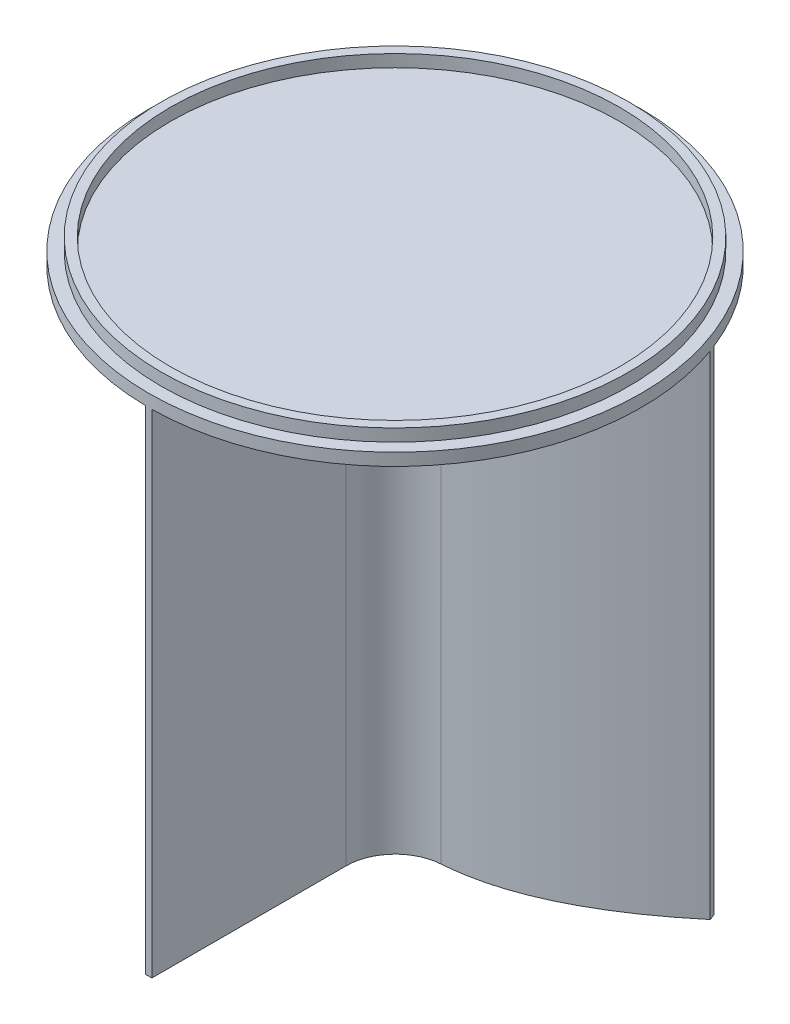
ISO-10303-21;
HEADER;
FILE_DESCRIPTION(('STEP AP214'),'2;1');
FILE_NAME('part.step','',(''),(''),'','','');
FILE_SCHEMA(('AUTOMOTIVE_DESIGN { 1 0 10303 214 1 1 1 1 }'));
ENDSEC;
DATA;
#1=APPLICATION_CONTEXT('core data for automotive mechanical design processes');
#2=APPLICATION_PROTOCOL_DEFINITION('international standard','automotive_design',2000,#1);
#3=PRODUCT_CONTEXT('',#1,'mechanical');
#4=PRODUCT('Part','Part','',(#3));
#5=PRODUCT_RELATED_PRODUCT_CATEGORY('part','',(#4));
#6=PRODUCT_DEFINITION_FORMATION('','',#4);
#7=PRODUCT_DEFINITION_CONTEXT('part definition',#1,'design');
#8=PRODUCT_DEFINITION('design','',#6,#7);
#9=PRODUCT_DEFINITION_SHAPE('','',#8);
#10=(LENGTH_UNIT() NAMED_UNIT(*) SI_UNIT(.MILLI.,.METRE.));
#11=(NAMED_UNIT(*) PLANE_ANGLE_UNIT() SI_UNIT($,.RADIAN.));
#12=(NAMED_UNIT(*) SI_UNIT($,.STERADIAN.) SOLID_ANGLE_UNIT());
#13=UNCERTAINTY_MEASURE_WITH_UNIT(LENGTH_MEASURE(1.E-05),#10,'distance_accuracy_value','');
#14=(GEOMETRIC_REPRESENTATION_CONTEXT(3) GLOBAL_UNCERTAINTY_ASSIGNED_CONTEXT((#13)) GLOBAL_UNIT_ASSIGNED_CONTEXT((#10,
#11,#12)) REPRESENTATION_CONTEXT('',''));
#15=CARTESIAN_POINT('',(0.,0.,0.));
#16=DIRECTION('',(0.,0.,1.));
#17=DIRECTION('',(1.,0.,0.));
#18=AXIS2_PLACEMENT_3D('',#15,#16,#17);
#19=CARTESIAN_POINT('',(0.,0.,0.));
#20=DIRECTION('',(0.,1.,0.));
#21=DIRECTION('',(0.,0.,1.));
#22=AXIS2_PLACEMENT_3D('',#19,#20,#21);
#23=PLANE('',#22);
#24=DIRECTION('',(0.,0.,1.));
#25=VECTOR('',#24,1.);
#26=CARTESIAN_POINT('',(0.79375000000035,0.,0.));
#27=LINE('',#26,#25);
#28=CARTESIAN_POINT('',(0.793750000000346,0.,13.4357994629598));
#29=VERTEX_POINT('',#28);
#30=CARTESIAN_POINT('',(0.793750000000334,0.,63.4950388686982));
#31=VERTEX_POINT('',#30);
#32=EDGE_CURVE('E200',#29,#31,#27,.T.);
#33=ORIENTED_EDGE('',*,*,#32,.F.);
#34=CARTESIAN_POINT('',(13.4937500000004,0.,13.4357994629598));
#35=DIRECTION('',(0.,1.,0.));
#36=DIRECTION('',(0.,0.,1.));
#37=AXIS2_PLACEMENT_3D('',#34,#35,#36);
#38=CIRCLE('',#37,12.7);
#39=CARTESIAN_POINT('',(12.6347730244322,0.,0.764881636872991));
#40=VERTEX_POINT('',#39);
#41=EDGE_CURVE('E255',#29,#40,#38,.F.);
#42=ORIENTED_EDGE('',*,*,#41,.T.);
#43=CARTESIAN_POINT('',(60.1646132042324,0.,-21.9068250928051));
#44=CARTESIAN_POINT('',(58.8450468444606,0.,-20.7942156371595));
#45=CARTESIAN_POINT('',(56.1352624774643,0.,-18.5848779952898));
#46=CARTESIAN_POINT('',(52.1639932822609,0.,-15.574258653446));
#47=CARTESIAN_POINT('',(48.2100035658727,0.,-12.8032932799032));
#48=CARTESIAN_POINT('',(42.9904747725905,0.,-9.45279675299927));
#49=CARTESIAN_POINT('',(36.5497610288508,0.,-5.89761641735431));
#50=CARTESIAN_POINT('',(28.9596288228181,0.,-2.64839128734228));
#51=CARTESIAN_POINT('',(21.5077081779563,0.,-0.414484498438768));
#52=CARTESIAN_POINT('',(11.7515528311367,0.,1.20819345940065));
#53=CARTESIAN_POINT('',(4.65987191247486,0.,0.905685246697718));
#54=CARTESIAN_POINT('',(-2.16677804171228E-13,0.,0.0219432709652298));
#55=B_SPLINE_CURVE_WITH_KNOTS('',3,(#43,#44,#45,#46,#47,#48,#49,#50,#51,#52,#53,#54),
.UNSPECIFIED.,.F.,.F.,(4,1,1,1,1,1,1,1,1,4),(-0.00413028523454447,0.0582863741057797,
0.120703033446104,0.183119692786428,0.245536352126752,0.3703696708074,0.495202989488049,
0.620036308168697,0.744869626849345,0.994536264210642),.UNSPECIFIED.);
#56=CARTESIAN_POINT('',(59.7334136017483,0.,-21.5445886357218));
#57=VERTEX_POINT('',#56);
#58=EDGE_CURVE('E204',#57,#40,#55,.T.);
#59=ORIENTED_EDGE('',*,*,#58,.F.);
#60=CARTESIAN_POINT('',(0.,0.,0.));
#61=DIRECTION('',(0.,1.,0.));
#62=DIRECTION('',(0.,0.,1.));
#63=AXIS2_PLACEMENT_3D('',#60,#61,#62);
#64=CIRCLE('',#63,63.5);
#65=EDGE_CURVE('E247',#31,#57,#64,.T.);
#66=ORIENTED_EDGE('',*,*,#65,.F.);
#67=EDGE_LOOP('',(#33,#42,#59,#66));
#68=FACE_BOUND('',#67,.T.);
#69=ADVANCED_FACE('F39',(#68),#23,.F.);
#70=CARTESIAN_POINT('',(59.1412968431932,0.,-23.120488915793));
#71=VERTEX_POINT('',#70);
#72=CARTESIAN_POINT('',(-59.1412968431932,0.,-23.120488915793));
#73=VERTEX_POINT('',#72);
#74=EDGE_CURVE('E249',#71,#73,#64,.T.);
#75=ORIENTED_EDGE('',*,*,#74,.F.);
#76=CARTESIAN_POINT('',(59.1412968431932,0.,-23.120488915793));
#77=CARTESIAN_POINT('',(58.3433566948261,0.,-22.4476953518027));
#78=CARTESIAN_POINT('',(56.8593340313466,0.,-21.2217409701074));
#79=CARTESIAN_POINT('',(54.0797714537641,0.,-19.0127059130032));
#80=CARTESIAN_POINT('',(50.8035362996228,0.,-16.5482726571743));
#81=CARTESIAN_POINT('',(46.9145065335919,0.,-13.8476719735552));
#82=CARTESIAN_POINT('',(41.7808625192654,0.,-10.5841338383356));
#83=CARTESIAN_POINT('',(35.4645511728603,0.,-7.13817056857684));
#84=CARTESIAN_POINT('',(28.0482197088023,0.,-4.01107351091719));
#85=CARTESIAN_POINT('',(20.7974551617018,0.,-1.88480642992618));
#86=CARTESIAN_POINT('',(11.34212116134,0.,-0.373927814679988));
#87=CARTESIAN_POINT('',(4.4976805154353,0.,-0.712511058251194));
#88=CARTESIAN_POINT('',(0.,0.,-1.59481724896914));
#89=B_SPLINE_CURVE_WITH_KNOTS('',3,(#76,#77,#78,#79,#80,#81,#82,#83,#84,#85,#86,#87,#88),
.UNSPECIFIED.,.F.,.F.,(4,1,1,1,1,1,1,1,1,1,4),(-0.00413028523454447,0.0339096103706156,
0.0650738164876925,0.127402228721846,0.189730640956,0.252059053190154,0.376715877658462,
0.501372702126769,0.626029526595077,0.750686351063385,1.),.UNSPECIFIED.);
#90=CARTESIAN_POINT('',(0.,0.,-1.59481724896914));
#91=VERTEX_POINT('',#90);
#92=EDGE_CURVE('E212',#71,#91,#89,.T.);
#93=ORIENTED_EDGE('',*,*,#92,.T.);
#94=CARTESIAN_POINT('',(0.,0.,-1.59481724896914));
#95=CARTESIAN_POINT('',(-4.49768051543962,0.,-0.712511058251614));
#96=CARTESIAN_POINT('',(-11.3421211613504,0.,-0.373927814682113));
#97=CARTESIAN_POINT('',(-20.7974551617196,0.,-1.88480642993252));
#98=CARTESIAN_POINT('',(-28.0482197088252,0.,-4.01107351092743));
#99=CARTESIAN_POINT('',(-35.464551172888,0.,-7.13817056859184));
#100=CARTESIAN_POINT('',(-41.780862519297,0.,-10.5841338383553));
#101=CARTESIAN_POINT('',(-46.9145065336265,0.,-13.847671973579));
#102=CARTESIAN_POINT('',(-50.8035362996596,0.,-16.5482726572014));
#103=CARTESIAN_POINT('',(-54.0797714538027,0.,-19.0127059130333));
#104=CARTESIAN_POINT('',(-56.8593340313729,0.,-21.2217409701291));
#105=CARTESIAN_POINT('',(-58.3433566948389,0.,-22.4476953518135));
#106=CARTESIAN_POINT('',(-59.1412968431932,0.,-23.120488915793));
#107=B_SPLINE_CURVE_WITH_KNOTS('',3,(#94,#95,#96,#97,#98,#99,#100,#101,#102,#103,#104,#105,
#106),.UNSPECIFIED.,.F.,.F.,(4,1,1,1,1,1,1,1,1,1,4),(0.00274540425350602,0.252059053190154,
0.376715877658462,0.501372702126769,0.626029526595077,0.750686351063385,0.813014763297538,
0.875343175531692,0.937671587765846,0.968835793882923,1.00687568948743),.UNSPECIFIED.);
#108=EDGE_CURVE('E282',#91,#73,#107,.T.);
#109=ORIENTED_EDGE('',*,*,#108,.T.);
#110=EDGE_LOOP('',(#75,#93,#109));
#111=FACE_BOUND('',#110,.T.);
#112=ADVANCED_FACE('F298',(#111),#23,.F.);
#113=CARTESIAN_POINT('',(0.,3.175,0.));
#114=DIRECTION('',(0.,-1.,0.));
#115=DIRECTION('',(0.,0.,-1.));
#116=AXIS2_PLACEMENT_3D('',#113,#114,#115);
#117=CYLINDRICAL_SURFACE('',#116,63.5);
#118=CARTESIAN_POINT('',(0.,3.175,0.));
#119=DIRECTION('',(0.,1.,0.));
#120=DIRECTION('',(0.,0.,1.));
#121=AXIS2_PLACEMENT_3D('',#118,#119,#120);
#122=CIRCLE('',#121,63.5);
#123=CARTESIAN_POINT('',(0.,3.175,63.5));
#124=VERTEX_POINT('',#123);
#125=EDGE_CURVE('E243',#124,#124,#122,.T.);
#126=ORIENTED_EDGE('',*,*,#125,.F.);
#127=EDGE_LOOP('',(#126));
#128=FACE_BOUND('',#127,.T.);
#129=ORIENTED_EDGE('',*,*,#65,.T.);
#130=DIRECTION('',(0.,1.,0.));
#131=VECTOR('',#130,1.);
#132=CARTESIAN_POINT('',(59.7334136017483,-127.,-21.5445886357218));
#133=LINE('',#132,#131);
#134=CARTESIAN_POINT('',(59.7334136017483,-127.,-21.5445886357218));
#135=VERTEX_POINT('',#134);
#136=EDGE_CURVE('E224',#135,#57,#133,.T.);
#137=ORIENTED_EDGE('',*,*,#136,.F.);
#138=CARTESIAN_POINT('',(0.,-127.,0.));
#139=DIRECTION('',(0.,-1.,0.));
#140=DIRECTION('',(0.,0.,-1.));
#141=AXIS2_PLACEMENT_3D('',#138,#139,#140);
#142=CIRCLE('',#141,63.5);
#143=CARTESIAN_POINT('',(59.1412968431932,-127.,-23.120488915793));
#144=VERTEX_POINT('',#143);
#145=EDGE_CURVE('E150',#144,#135,#142,.T.);
#146=ORIENTED_EDGE('',*,*,#145,.F.);
#147=DIRECTION('',(0.,1.,0.));
#148=VECTOR('',#147,1.);
#149=CARTESIAN_POINT('',(59.1412968431932,-127.,-23.120488915793));
#150=LINE('',#149,#148);
#151=EDGE_CURVE('E227',#144,#71,#150,.T.);
#152=ORIENTED_EDGE('',*,*,#151,.T.);
#153=ORIENTED_EDGE('',*,*,#74,.T.);
#154=DIRECTION('',(0.,1.,0.));
#155=VECTOR('',#154,1.);
#156=CARTESIAN_POINT('',(-59.1412968431932,-127.,-23.120488915793));
#157=LINE('',#156,#155);
#158=CARTESIAN_POINT('',(-59.1412968431932,-127.,-23.120488915793));
#159=VERTEX_POINT('',#158);
#160=EDGE_CURVE('E141',#159,#73,#157,.T.);
#161=ORIENTED_EDGE('',*,*,#160,.F.);
#162=CARTESIAN_POINT('',(-59.7334136017483,-127.,-21.5445886357218));
#163=VERTEX_POINT('',#162);
#164=EDGE_CURVE('E125',#163,#159,#142,.T.);
#165=ORIENTED_EDGE('',*,*,#164,.F.);
#166=DIRECTION('',(0.,1.,0.));
#167=VECTOR('',#166,1.);
#168=CARTESIAN_POINT('',(-59.7334136017483,-127.,-21.5445886357218));
#169=LINE('',#168,#167);
#170=CARTESIAN_POINT('',(-59.7334136017483,0.,-21.5445886357218));
#171=VERTEX_POINT('',#170);
#172=EDGE_CURVE('E134',#163,#171,#169,.T.);
#173=ORIENTED_EDGE('',*,*,#172,.T.);
#174=CARTESIAN_POINT('',(-0.79375000000035,0.,63.4950388686982));
#175=VERTEX_POINT('',#174);
#176=EDGE_CURVE('E240',#171,#175,#64,.T.);
#177=ORIENTED_EDGE('',*,*,#176,.T.);
#178=DIRECTION('',(0.,1.,0.));
#179=VECTOR('',#178,1.);
#180=CARTESIAN_POINT('',(-0.79375000000035,-127.,63.4950388686982));
#181=LINE('',#180,#179);
#182=CARTESIAN_POINT('',(-0.79375000000035,-127.,63.4950388686982));
#183=VERTEX_POINT('',#182);
#184=EDGE_CURVE('E218',#183,#175,#181,.T.);
#185=ORIENTED_EDGE('',*,*,#184,.F.);
#186=CARTESIAN_POINT('',(0.,-127.,0.));
#187=DIRECTION('',(0.,-1.,0.));
#188=DIRECTION('',(0.,0.,-1.));
#189=AXIS2_PLACEMENT_3D('',#186,#187,#188);
#190=CIRCLE('',#189,63.5);
#191=CARTESIAN_POINT('',(0.793750000000334,-127.,63.4950388686982));
#192=VERTEX_POINT('',#191);
#193=EDGE_CURVE('E221',#192,#183,#190,.T.);
#194=ORIENTED_EDGE('',*,*,#193,.F.);
#195=DIRECTION('',(0.,1.,0.));
#196=VECTOR('',#195,1.);
#197=CARTESIAN_POINT('',(0.793750000000334,-127.,63.4950388686982));
#198=LINE('',#197,#196);
#199=EDGE_CURVE('E220',#192,#31,#198,.T.);
#200=ORIENTED_EDGE('',*,*,#199,.T.);
#201=EDGE_LOOP('',(#129,#137,#146,#152,#153,#161,#165,#173,#177,#185,#194,#200));
#202=FACE_BOUND('',#201,.T.);
#203=ADVANCED_FACE('F144',(#128,#202),#117,.T.);
#204=CARTESIAN_POINT('',(0.,3.175,0.));
#205=DIRECTION('',(0.,1.,0.));
#206=DIRECTION('',(0.,0.,1.));
#207=AXIS2_PLACEMENT_3D('',#204,#205,#206);
#208=PLANE('',#207);
#209=CARTESIAN_POINT('',(0.,3.175,0.));
#210=DIRECTION('',(0.,1.,0.));
#211=DIRECTION('',(0.,0.,1.));
#212=AXIS2_PLACEMENT_3D('',#209,#210,#211);
#213=CIRCLE('',#212,60.325);
#214=CARTESIAN_POINT('',(0.,3.175,60.325));
#215=VERTEX_POINT('',#214);
#216=EDGE_CURVE('E236',#215,#215,#213,.T.);
#217=ORIENTED_EDGE('',*,*,#216,.F.);
#218=EDGE_LOOP('',(#217));
#219=FACE_BOUND('',#218,.T.);
#220=ORIENTED_EDGE('',*,*,#125,.T.);
#221=EDGE_LOOP('',(#220));
#222=FACE_BOUND('',#221,.T.);
#223=ADVANCED_FACE('F304',(#219,#222),#208,.T.);
#224=CARTESIAN_POINT('',(-2.16677804171228E-13,0.,0.0219432709652292));
#225=CARTESIAN_POINT('',(-4.65987191247611,0.,0.905685246696586));
#226=CARTESIAN_POINT('',(-11.7515528311389,0.,1.2081934593983));
#227=CARTESIAN_POINT('',(-21.507708177959,0.,-0.414484498441885));
#228=CARTESIAN_POINT('',(-28.9596288228209,0.,-2.64839128734552));
#229=CARTESIAN_POINT('',(-36.5497610288533,0.,-5.89761641735724));
#230=CARTESIAN_POINT('',(-42.9904747725923,0.,-9.4527967530016));
#231=CARTESIAN_POINT('',(-48.2100035658739,0.,-12.8032932799049));
#232=CARTESIAN_POINT('',(-52.1639932822616,0.,-15.574258653447));
#233=CARTESIAN_POINT('',(-56.1352624774642,0.,-18.58487799529));
#234=CARTESIAN_POINT('',(-58.8450468444606,0.,-20.7942156371596));
#235=CARTESIAN_POINT('',(-60.1646132042323,0.,-21.906825092805));
#236=B_SPLINE_CURVE_WITH_KNOTS('',3,(#224,#225,#226,#227,#228,#229,#230,#231,#232,#233,#234,
#235),.UNSPECIFIED.,.F.,.F.,(4,1,1,1,1,1,1,1,1,4),(0.00820914004286144,0.257875777404003,
0.382709096084573,0.507542414765144,0.632375733445715,0.757209052126285,0.819625711466571,
0.882042370806856,0.944459030147141,1.00687568948743),.UNSPECIFIED.);
#237=CARTESIAN_POINT('',(-12.6347730244315,0.,0.7648816368709));
#238=VERTEX_POINT('',#237);
#239=EDGE_CURVE('E136',#238,#171,#236,.T.);
#240=ORIENTED_EDGE('',*,*,#239,.F.);
#241=CARTESIAN_POINT('',(-13.4937500000003,0.,13.4357994629576));
#242=DIRECTION('',(0.,1.,0.));
#243=DIRECTION('',(0.,0.,1.));
#244=AXIS2_PLACEMENT_3D('',#241,#242,#243);
#245=CIRCLE('',#244,12.7);
#246=CARTESIAN_POINT('',(-0.79375000000035,0.,13.4357994629576));
#247=VERTEX_POINT('',#246);
#248=EDGE_CURVE('E62',#238,#247,#245,.F.);
#249=ORIENTED_EDGE('',*,*,#248,.T.);
#250=DIRECTION('',(0.,0.,1.));
#251=VECTOR('',#250,1.);
#252=CARTESIAN_POINT('',(-0.79375000000035,0.,0.));
#253=LINE('',#252,#251);
#254=EDGE_CURVE('E277',#247,#175,#253,.T.);
#255=ORIENTED_EDGE('',*,*,#254,.T.);
#256=ORIENTED_EDGE('',*,*,#176,.F.);
#257=EDGE_LOOP('',(#240,#249,#255,#256));
#258=FACE_BOUND('',#257,.T.);
#259=ADVANCED_FACE('F301',(#258),#23,.F.);
#260=CARTESIAN_POINT('',(0.,6.35,0.));
#261=DIRECTION('',(0.,1.,0.));
#262=DIRECTION('',(0.,0.,1.));
#263=AXIS2_PLACEMENT_3D('',#260,#261,#262);
#264=PLANE('',#263);
#265=CARTESIAN_POINT('',(0.,6.35,0.));
#266=DIRECTION('',(0.,1.,0.));
#267=DIRECTION('',(0.,0.,1.));
#268=AXIS2_PLACEMENT_3D('',#265,#266,#267);
#269=CIRCLE('',#268,60.325);
#270=CARTESIAN_POINT('',(0.,6.35,60.325));
#271=VERTEX_POINT('',#270);
#272=EDGE_CURVE('E237',#271,#271,#269,.T.);
#273=ORIENTED_EDGE('',*,*,#272,.T.);
#274=EDGE_LOOP('',(#273));
#275=FACE_BOUND('',#274,.T.);
#276=CARTESIAN_POINT('',(0.,6.35,0.));
#277=DIRECTION('',(0.,1.,0.));
#278=DIRECTION('',(0.,0.,1.));
#279=AXIS2_PLACEMENT_3D('',#276,#277,#278);
#280=CIRCLE('',#279,57.94375);
#281=CARTESIAN_POINT('',(0.,6.35,57.94375));
#282=VERTEX_POINT('',#281);
#283=EDGE_CURVE('E140',#282,#282,#280,.T.);
#284=ORIENTED_EDGE('',*,*,#283,.F.);
#285=EDGE_LOOP('',(#284));
#286=FACE_BOUND('',#285,.T.);
#287=ADVANCED_FACE('F303',(#275,#286),#264,.T.);
#288=CARTESIAN_POINT('',(0.,6.35,0.));
#289=DIRECTION('',(0.,-1.,0.));
#290=DIRECTION('',(0.,0.,-1.));
#291=AXIS2_PLACEMENT_3D('',#288,#289,#290);
#292=CYLINDRICAL_SURFACE('',#291,60.325);
#293=ORIENTED_EDGE('',*,*,#272,.F.);
#294=EDGE_LOOP('',(#293));
#295=FACE_BOUND('',#294,.T.);
#296=ORIENTED_EDGE('',*,*,#216,.T.);
#297=EDGE_LOOP('',(#296));
#298=FACE_BOUND('',#297,.T.);
#299=ADVANCED_FACE('F310',(#295,#298),#292,.T.);
#300=CARTESIAN_POINT('',(0.,6.35,0.));
#301=DIRECTION('',(0.,-1.,0.));
#302=DIRECTION('',(0.,0.,-1.));
#303=AXIS2_PLACEMENT_3D('',#300,#301,#302);
#304=CYLINDRICAL_SURFACE('',#303,57.94375);
#305=ORIENTED_EDGE('',*,*,#283,.T.);
#306=EDGE_LOOP('',(#305));
#307=FACE_BOUND('',#306,.T.);
#308=CARTESIAN_POINT('',(0.,3.175,0.));
#309=DIRECTION('',(0.,1.,0.));
#310=DIRECTION('',(0.,0.,1.));
#311=AXIS2_PLACEMENT_3D('',#308,#309,#310);
#312=CIRCLE('',#311,57.94375);
#313=CARTESIAN_POINT('',(0.,3.175,57.94375));
#314=VERTEX_POINT('',#313);
#315=EDGE_CURVE('E246',#314,#314,#312,.F.);
#316=ORIENTED_EDGE('',*,*,#315,.T.);
#317=EDGE_LOOP('',(#316));
#318=FACE_BOUND('',#317,.T.);
#319=ADVANCED_FACE('F363',(#307,#318),#304,.F.);
#320=ORIENTED_EDGE('',*,*,#315,.F.);
#321=EDGE_LOOP('',(#320));
#322=FACE_BOUND('',#321,.T.);
#323=ADVANCED_FACE('F315',(#322),#208,.T.);
#324=CARTESIAN_POINT('',(-0.79375000000035,-127.,0.));
#325=DIRECTION('',(-1.,0.,0.));
#326=DIRECTION('',(0.,0.,1.));
#327=AXIS2_PLACEMENT_3D('',#324,#325,#326);
#328=PLANE('',#327);
#329=ORIENTED_EDGE('',*,*,#254,.F.);
#330=DIRECTION('',(0.,1.,0.));
#331=VECTOR('',#330,1.);
#332=CARTESIAN_POINT('',(-0.79375000000035,-127.,13.4357994629576));
#333=LINE('',#332,#331);
#334=CARTESIAN_POINT('',(-0.79375000000035,-127.,13.4357994629576));
#335=VERTEX_POINT('',#334);
#336=EDGE_CURVE('E54',#247,#335,#333,.F.);
#337=ORIENTED_EDGE('',*,*,#336,.T.);
#338=DIRECTION('',(0.,0.,1.));
#339=VECTOR('',#338,1.);
#340=CARTESIAN_POINT('',(-0.79375000000035,-127.,0.));
#341=LINE('',#340,#339);
#342=EDGE_CURVE('E131',#335,#183,#341,.T.);
#343=ORIENTED_EDGE('',*,*,#342,.T.);
#344=ORIENTED_EDGE('',*,*,#184,.T.);
#345=EDGE_LOOP('',(#329,#337,#343,#344));
#346=FACE_BOUND('',#345,.T.);
#347=ADVANCED_FACE('F190',(#346),#328,.T.);
#348=CARTESIAN_POINT('',(-2.16677804171228E-13,-127.,0.0219432709652292));
#349=CARTESIAN_POINT('',(-4.65987191247611,-127.,0.905685246696586));
#350=CARTESIAN_POINT('',(-11.7515528311389,-127.,1.2081934593983));
#351=CARTESIAN_POINT('',(-21.507708177959,-127.,-0.414484498441885));
#352=CARTESIAN_POINT('',(-28.9596288228209,-127.,-2.64839128734552));
#353=CARTESIAN_POINT('',(-36.5497610288533,-127.,-5.89761641735724));
#354=CARTESIAN_POINT('',(-42.9904747725923,-127.,-9.4527967530016));
#355=CARTESIAN_POINT('',(-48.2100035658739,-127.,-12.8032932799049));
#356=CARTESIAN_POINT('',(-52.1639932822616,-127.,-15.574258653447));
#357=CARTESIAN_POINT('',(-56.1352624774642,-127.,-18.58487799529));
#358=CARTESIAN_POINT('',(-58.8450468444606,-127.,-20.7942156371596));
#359=CARTESIAN_POINT('',(-60.1646132042323,-127.,-21.906825092805));
#360=B_SPLINE_CURVE_WITH_KNOTS('',3,(#348,#349,#350,#351,#352,#353,#354,#355,#356,#357,#358,
#359),.UNSPECIFIED.,.F.,.F.,(4,1,1,1,1,1,1,1,1,4),(0.00820914004286144,0.257875777404003,
0.382709096084573,0.507542414765144,0.632375733445715,0.757209052126285,0.819625711466571,
0.882042370806856,0.944459030147141,1.00687568948743),.UNSPECIFIED.);
#361=DIRECTION('',(0.,1.,0.));
#362=VECTOR('',#361,1.);
#363=SURFACE_OF_LINEAR_EXTRUSION('',#360,#362);
#364=CARTESIAN_POINT('',(-12.6347730244315,-127.,0.7648816368709));
#365=VERTEX_POINT('',#364);
#366=EDGE_CURVE('E120',#365,#163,#360,.T.);
#367=ORIENTED_EDGE('',*,*,#366,.F.);
#368=DIRECTION('',(0.,1.,0.));
#369=VECTOR('',#368,1.);
#370=CARTESIAN_POINT('',(-12.6347730244315,-127.,0.7648816368709));
#371=LINE('',#370,#369);
#372=EDGE_CURVE('E259',#365,#238,#371,.T.);
#373=ORIENTED_EDGE('',*,*,#372,.T.);
#374=ORIENTED_EDGE('',*,*,#239,.T.);
#375=ORIENTED_EDGE('',*,*,#172,.F.);
#376=EDGE_LOOP('',(#367,#373,#374,#375));
#377=FACE_BOUND('',#376,.T.);
#378=ADVANCED_FACE('F135',(#377),#363,.F.);
#379=CARTESIAN_POINT('',(0.,-127.,-1.59481724896914));
#380=CARTESIAN_POINT('',(-4.49768051543962,-127.,-0.712511058251614));
#381=CARTESIAN_POINT('',(-11.3421211613504,-127.,-0.373927814682113));
#382=CARTESIAN_POINT('',(-20.7974551617196,-127.,-1.88480642993252));
#383=CARTESIAN_POINT('',(-28.0482197088252,-127.,-4.01107351092743));
#384=CARTESIAN_POINT('',(-35.464551172888,-127.,-7.13817056859184));
#385=CARTESIAN_POINT('',(-41.780862519297,-127.,-10.5841338383553));
#386=CARTESIAN_POINT('',(-46.9145065336265,-127.,-13.847671973579));
#387=CARTESIAN_POINT('',(-50.8035362996596,-127.,-16.5482726572014));
#388=CARTESIAN_POINT('',(-54.0797714538027,-127.,-19.0127059130333));
#389=CARTESIAN_POINT('',(-56.8593340313729,-127.,-21.2217409701291));
#390=CARTESIAN_POINT('',(-58.3433566948389,-127.,-22.4476953518135));
#391=CARTESIAN_POINT('',(-59.1412968431932,-127.,-23.120488915793));
#392=B_SPLINE_CURVE_WITH_KNOTS('',3,(#379,#380,#381,#382,#383,#384,#385,#386,#387,#388,#389,
#390,#391),.UNSPECIFIED.,.F.,.F.,(4,1,1,1,1,1,1,1,1,1,4),(0.00274540425350602,0.252059053190154,
0.376715877658462,0.501372702126769,0.626029526595077,0.750686351063385,0.813014763297538,
0.875343175531692,0.937671587765846,0.968835793882923,1.00687568948743),.UNSPECIFIED.);
#393=DIRECTION('',(0.,1.,0.));
#394=VECTOR('',#393,1.);
#395=SURFACE_OF_LINEAR_EXTRUSION('',#392,#394);
#396=ORIENTED_EDGE('',*,*,#108,.F.);
#397=DIRECTION('',(0.,1.,0.));
#398=VECTOR('',#397,1.);
#399=CARTESIAN_POINT('',(0.,-127.,-1.59481724896914));
#400=LINE('',#399,#398);
#401=CARTESIAN_POINT('',(0.,-127.,-1.59481724896914));
#402=VERTEX_POINT('',#401);
#403=EDGE_CURVE('E230',#402,#91,#400,.T.);
#404=ORIENTED_EDGE('',*,*,#403,.F.);
#405=EDGE_CURVE('E148',#402,#159,#392,.T.);
#406=ORIENTED_EDGE('',*,*,#405,.T.);
#407=ORIENTED_EDGE('',*,*,#160,.T.);
#408=EDGE_LOOP('',(#396,#404,#406,#407));
#409=FACE_BOUND('',#408,.T.);
#410=ADVANCED_FACE('F183',(#409),#395,.T.);
#411=CARTESIAN_POINT('',(59.1412968431932,-127.,-23.120488915793));
#412=CARTESIAN_POINT('',(58.3433566948261,-127.,-22.4476953518027));
#413=CARTESIAN_POINT('',(56.8593340313466,-127.,-21.2217409701074));
#414=CARTESIAN_POINT('',(54.0797714537641,-127.,-19.0127059130032));
#415=CARTESIAN_POINT('',(50.8035362996228,-127.,-16.5482726571743));
#416=CARTESIAN_POINT('',(46.9145065335919,-127.,-13.8476719735552));
#417=CARTESIAN_POINT('',(41.7808625192654,-127.,-10.5841338383356));
#418=CARTESIAN_POINT('',(35.4645511728603,-127.,-7.13817056857684));
#419=CARTESIAN_POINT('',(28.0482197088023,-127.,-4.01107351091719));
#420=CARTESIAN_POINT('',(20.7974551617018,-127.,-1.88480642992618));
#421=CARTESIAN_POINT('',(11.34212116134,-127.,-0.373927814679988));
#422=CARTESIAN_POINT('',(4.4976805154353,-127.,-0.712511058251194));
#423=CARTESIAN_POINT('',(0.,-127.,-1.59481724896914));
#424=B_SPLINE_CURVE_WITH_KNOTS('',3,(#411,#412,#413,#414,#415,#416,#417,#418,#419,#420,#421,
#422,#423),.UNSPECIFIED.,.F.,.F.,(4,1,1,1,1,1,1,1,1,1,4),(-0.00413028523454447,
0.0339096103706156,0.0650738164876925,0.127402228721846,0.189730640956,0.252059053190154,
0.376715877658462,0.501372702126769,0.626029526595077,0.750686351063385,1.),.UNSPECIFIED.);
#425=DIRECTION('',(0.,1.,0.));
#426=VECTOR('',#425,1.);
#427=SURFACE_OF_LINEAR_EXTRUSION('',#424,#426);
#428=ORIENTED_EDGE('',*,*,#92,.F.);
#429=ORIENTED_EDGE('',*,*,#151,.F.);
#430=EDGE_CURVE('E151',#144,#402,#424,.T.);
#431=ORIENTED_EDGE('',*,*,#430,.T.);
#432=ORIENTED_EDGE('',*,*,#403,.T.);
#433=EDGE_LOOP('',(#428,#429,#431,#432));
#434=FACE_BOUND('',#433,.T.);
#435=ADVANCED_FACE('F178',(#434),#427,.T.);
#436=CARTESIAN_POINT('',(60.1646132042324,-127.,-21.9068250928051));
#437=CARTESIAN_POINT('',(58.8450468444606,-127.,-20.7942156371595));
#438=CARTESIAN_POINT('',(56.1352624774643,-127.,-18.5848779952898));
#439=CARTESIAN_POINT('',(52.1639932822609,-127.,-15.574258653446));
#440=CARTESIAN_POINT('',(48.2100035658727,-127.,-12.8032932799032));
#441=CARTESIAN_POINT('',(42.9904747725905,-127.,-9.45279675299927));
#442=CARTESIAN_POINT('',(36.5497610288508,-127.,-5.89761641735431));
#443=CARTESIAN_POINT('',(28.9596288228181,-127.,-2.64839128734228));
#444=CARTESIAN_POINT('',(21.5077081779563,-127.,-0.414484498438768));
#445=CARTESIAN_POINT('',(11.7515528311367,-127.,1.20819345940065));
#446=CARTESIAN_POINT('',(4.65987191247486,-127.,0.905685246697718));
#447=CARTESIAN_POINT('',(-2.16677804171228E-13,-127.,0.0219432709652298));
#448=B_SPLINE_CURVE_WITH_KNOTS('',3,(#436,#437,#438,#439,#440,#441,#442,#443,#444,#445,#446,
#447),.UNSPECIFIED.,.F.,.F.,(4,1,1,1,1,1,1,1,1,4),(-0.00413028523454447,0.0582863741057797,
0.120703033446104,0.183119692786428,0.245536352126752,0.3703696708074,0.495202989488049,
0.620036308168697,0.744869626849345,0.994536264210642),.UNSPECIFIED.);
#449=DIRECTION('',(0.,1.,0.));
#450=VECTOR('',#449,1.);
#451=SURFACE_OF_LINEAR_EXTRUSION('',#448,#450);
#452=ORIENTED_EDGE('',*,*,#58,.T.);
#453=DIRECTION('',(0.,1.,0.));
#454=VECTOR('',#453,1.);
#455=CARTESIAN_POINT('',(12.6347730244322,0.,0.764881636872991));
#456=LINE('',#455,#454);
#457=CARTESIAN_POINT('',(12.6347730244322,-127.,0.764881636872991));
#458=VERTEX_POINT('',#457);
#459=EDGE_CURVE('E257',#40,#458,#456,.F.);
#460=ORIENTED_EDGE('',*,*,#459,.T.);
#461=EDGE_CURVE('E153',#135,#458,#448,.T.);
#462=ORIENTED_EDGE('',*,*,#461,.F.);
#463=ORIENTED_EDGE('',*,*,#136,.T.);
#464=EDGE_LOOP('',(#452,#460,#462,#463));
#465=FACE_BOUND('',#464,.T.);
#466=ADVANCED_FACE('F182',(#465),#451,.F.);
#467=CARTESIAN_POINT('',(0.79375000000035,-127.,0.));
#468=DIRECTION('',(-1.,0.,0.));
#469=DIRECTION('',(0.,0.,1.));
#470=AXIS2_PLACEMENT_3D('',#467,#468,#469);
#471=PLANE('',#470);
#472=DIRECTION('',(0.,0.,1.));
#473=VECTOR('',#472,1.);
#474=CARTESIAN_POINT('',(0.79375000000035,-127.,0.));
#475=LINE('',#474,#473);
#476=CARTESIAN_POINT('',(0.793750000000346,-127.,13.4357994629598));
#477=VERTEX_POINT('',#476);
#478=EDGE_CURVE('E158',#477,#192,#475,.T.);
#479=ORIENTED_EDGE('',*,*,#478,.F.);
#480=DIRECTION('',(0.,-1.,0.));
#481=VECTOR('',#480,1.);
#482=CARTESIAN_POINT('',(0.793750000000346,0.,13.4357994629598));
#483=LINE('',#482,#481);
#484=EDGE_CURVE('E252',#477,#29,#483,.F.);
#485=ORIENTED_EDGE('',*,*,#484,.T.);
#486=ORIENTED_EDGE('',*,*,#32,.T.);
#487=ORIENTED_EDGE('',*,*,#199,.F.);
#488=EDGE_LOOP('',(#479,#485,#486,#487));
#489=FACE_BOUND('',#488,.T.);
#490=ADVANCED_FACE('F269',(#489),#471,.F.);
#491=CARTESIAN_POINT('',(0.,-127.,0.));
#492=DIRECTION('',(0.,-1.,0.));
#493=DIRECTION('',(0.,0.,-1.));
#494=AXIS2_PLACEMENT_3D('',#491,#492,#493);
#495=PLANE('',#494);
#496=ORIENTED_EDGE('',*,*,#342,.F.);
#497=CARTESIAN_POINT('',(-13.4937500000003,-127.,13.4357994629576));
#498=DIRECTION('',(0.,-1.,0.));
#499=DIRECTION('',(0.,0.,-1.));
#500=AXIS2_PLACEMENT_3D('',#497,#498,#499);
#501=CIRCLE('',#500,12.7);
#502=EDGE_CURVE('E11',#335,#365,#501,.F.);
#503=ORIENTED_EDGE('',*,*,#502,.T.);
#504=ORIENTED_EDGE('',*,*,#366,.T.);
#505=ORIENTED_EDGE('',*,*,#164,.T.);
#506=ORIENTED_EDGE('',*,*,#405,.F.);
#507=ORIENTED_EDGE('',*,*,#430,.F.);
#508=ORIENTED_EDGE('',*,*,#145,.T.);
#509=ORIENTED_EDGE('',*,*,#461,.T.);
#510=CARTESIAN_POINT('',(13.4937500000004,-127.,13.4357994629598));
#511=DIRECTION('',(0.,-1.,0.));
#512=DIRECTION('',(0.,0.,-1.));
#513=AXIS2_PLACEMENT_3D('',#510,#511,#512);
#514=CIRCLE('',#513,12.7);
#515=EDGE_CURVE('E47',#458,#477,#514,.F.);
#516=ORIENTED_EDGE('',*,*,#515,.T.);
#517=ORIENTED_EDGE('',*,*,#478,.T.);
#518=ORIENTED_EDGE('',*,*,#193,.T.);
#519=EDGE_LOOP('',(#496,#503,#504,#505,#506,#507,#508,#509,#516,#517,#518));
#520=FACE_BOUND('',#519,.T.);
#521=ADVANCED_FACE('F122',(#520),#495,.T.);
#522=CARTESIAN_POINT('',(13.4937500000004,-63.5,13.4357994629598));
#523=DIRECTION('',(0.,1.,0.));
#524=DIRECTION('',(0.,0.,1.));
#525=AXIS2_PLACEMENT_3D('',#522,#523,#524);
#526=CYLINDRICAL_SURFACE('',#525,12.7);
#527=ORIENTED_EDGE('',*,*,#515,.F.);
#528=ORIENTED_EDGE('',*,*,#459,.F.);
#529=ORIENTED_EDGE('',*,*,#41,.F.);
#530=ORIENTED_EDGE('',*,*,#484,.F.);
#531=EDGE_LOOP('',(#527,#528,#529,#530));
#532=FACE_BOUND('',#531,.T.);
#533=ADVANCED_FACE('F271',(#532),#526,.F.);
#534=CARTESIAN_POINT('',(-13.4937500000003,-63.5,13.4357994629576));
#535=DIRECTION('',(0.,1.,0.));
#536=DIRECTION('',(0.,0.,1.));
#537=AXIS2_PLACEMENT_3D('',#534,#535,#536);
#538=CYLINDRICAL_SURFACE('',#537,12.7);
#539=ORIENTED_EDGE('',*,*,#502,.F.);
#540=ORIENTED_EDGE('',*,*,#336,.F.);
#541=ORIENTED_EDGE('',*,*,#248,.F.);
#542=ORIENTED_EDGE('',*,*,#372,.F.);
#543=EDGE_LOOP('',(#539,#540,#541,#542));
#544=FACE_BOUND('',#543,.T.);
#545=ADVANCED_FACE('F41',(#544),#538,.F.);
#546=CLOSED_SHELL('',(#69,#112,#203,#223,#259,#287,#299,#319,#323,#347,#378,#410,#435,#466,#490,
#521,#533,#545));
#547=MANIFOLD_SOLID_BREP('B2',#546);
#548=ADVANCED_BREP_SHAPE_REPRESENTATION('',(#18,#547),#14);
#549=SHAPE_DEFINITION_REPRESENTATION(#9,#548);
ENDSEC;
END-ISO-10303-21;
